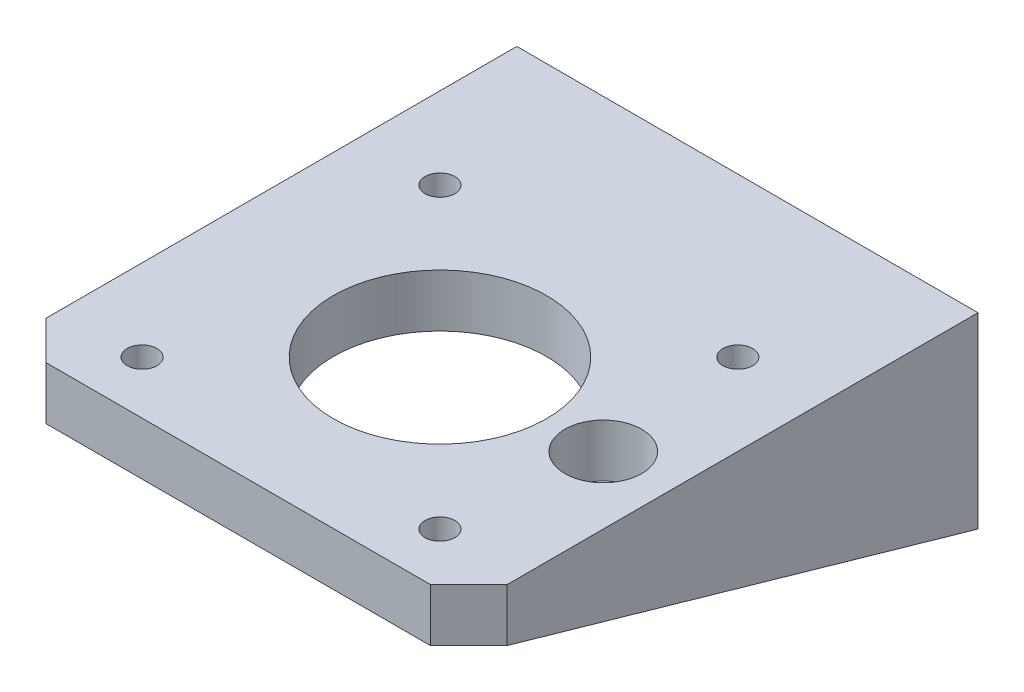
ISO-10303-21;
HEADER;
FILE_DESCRIPTION(('STEP AP214'),'2;1');
FILE_NAME('part.step','',(''),(''),'','','');
FILE_SCHEMA(('AUTOMOTIVE_DESIGN { 1 0 10303 214 1 1 1 1 }'));
ENDSEC;
DATA;
#1=APPLICATION_CONTEXT('core data for automotive mechanical design processes');
#2=APPLICATION_PROTOCOL_DEFINITION('international standard','automotive_design',2000,#1);
#3=PRODUCT_CONTEXT('',#1,'mechanical');
#4=PRODUCT('Part','Part','',(#3));
#5=PRODUCT_RELATED_PRODUCT_CATEGORY('part','',(#4));
#6=PRODUCT_DEFINITION_FORMATION('','',#4);
#7=PRODUCT_DEFINITION_CONTEXT('part definition',#1,'design');
#8=PRODUCT_DEFINITION('design','',#6,#7);
#9=PRODUCT_DEFINITION_SHAPE('','',#8);
#10=(LENGTH_UNIT() NAMED_UNIT(*) SI_UNIT(.MILLI.,.METRE.));
#11=(NAMED_UNIT(*) PLANE_ANGLE_UNIT() SI_UNIT($,.RADIAN.));
#12=(NAMED_UNIT(*) SI_UNIT($,.STERADIAN.) SOLID_ANGLE_UNIT());
#13=UNCERTAINTY_MEASURE_WITH_UNIT(LENGTH_MEASURE(1.E-05),#10,'distance_accuracy_value','');
#14=(GEOMETRIC_REPRESENTATION_CONTEXT(3) GLOBAL_UNCERTAINTY_ASSIGNED_CONTEXT((#13)) GLOBAL_UNIT_ASSIGNED_CONTEXT((#10,
#11,#12)) REPRESENTATION_CONTEXT('',''));
#15=CARTESIAN_POINT('',(0.,0.,0.));
#16=DIRECTION('',(0.,0.,1.));
#17=DIRECTION('',(1.,0.,0.));
#18=AXIS2_PLACEMENT_3D('',#15,#16,#17);
#19=CARTESIAN_POINT('',(39.,-5.71428571428571,-57.3840620433566));
#20=DIRECTION('',(0.,0.,1.));
#21=DIRECTION('',(1.,0.,0.));
#22=AXIS2_PLACEMENT_3D('',#19,#20,#21);
#23=CYLINDRICAL_SURFACE('',#22,1.55);
#24=CARTESIAN_POINT('',(39.,-5.71428571428571,-53.));
#25=DIRECTION('',(0.,0.,1.));
#26=DIRECTION('',(1.,0.,0.));
#27=AXIS2_PLACEMENT_3D('',#24,#25,#26);
#28=CIRCLE('',#27,1.55);
#29=CARTESIAN_POINT('',(40.55,-5.71428571428571,-53.));
#30=VERTEX_POINT('',#29);
#31=EDGE_CURVE('E248',#30,#30,#28,.F.);
#32=ORIENTED_EDGE('',*,*,#31,.T.);
#33=EDGE_LOOP('',(#32));
#34=FACE_BOUND('',#33,.T.);
#35=CARTESIAN_POINT('',(39.,-5.71428571428571,-47.));
#36=DIRECTION('',(0.,0.,1.));
#37=DIRECTION('',(1.,0.,0.));
#38=AXIS2_PLACEMENT_3D('',#35,#36,#37);
#39=CIRCLE('',#38,1.55);
#40=CARTESIAN_POINT('',(40.55,-5.71428571428571,-47.));
#41=VERTEX_POINT('',#40);
#42=EDGE_CURVE('E265',#41,#41,#39,.F.);
#43=ORIENTED_EDGE('',*,*,#42,.F.);
#44=EDGE_LOOP('',(#43));
#45=FACE_BOUND('',#44,.T.);
#46=ADVANCED_FACE('F33',(#34,#45),#23,.F.);
#47=CARTESIAN_POINT('',(9.,-5.71428571428571,-57.3840620433566));
#48=DIRECTION('',(0.,0.,1.));
#49=DIRECTION('',(1.,0.,0.));
#50=AXIS2_PLACEMENT_3D('',#47,#48,#49);
#51=CYLINDRICAL_SURFACE('',#50,1.55);
#52=CARTESIAN_POINT('',(9.,-5.71428571428571,-53.));
#53=DIRECTION('',(0.,0.,1.));
#54=DIRECTION('',(1.,0.,0.));
#55=AXIS2_PLACEMENT_3D('',#52,#53,#54);
#56=CIRCLE('',#55,1.55);
#57=CARTESIAN_POINT('',(10.55,-5.71428571428571,-53.));
#58=VERTEX_POINT('',#57);
#59=EDGE_CURVE('E246',#58,#58,#56,.F.);
#60=ORIENTED_EDGE('',*,*,#59,.T.);
#61=EDGE_LOOP('',(#60));
#62=FACE_BOUND('',#61,.T.);
#63=CARTESIAN_POINT('',(9.,-5.71428571428571,-47.));
#64=DIRECTION('',(0.,0.,1.));
#65=DIRECTION('',(1.,0.,0.));
#66=AXIS2_PLACEMENT_3D('',#63,#64,#65);
#67=CIRCLE('',#66,1.55);
#68=CARTESIAN_POINT('',(10.55,-5.71428571428571,-47.));
#69=VERTEX_POINT('',#68);
#70=EDGE_CURVE('E257',#69,#69,#67,.F.);
#71=ORIENTED_EDGE('',*,*,#70,.F.);
#72=EDGE_LOOP('',(#71));
#73=FACE_BOUND('',#72,.T.);
#74=ADVANCED_FACE('F275',(#62,#73),#51,.F.);
#75=CARTESIAN_POINT('',(0.,0.,0.));
#76=DIRECTION('',(0.,-1.,0.));
#77=DIRECTION('',(0.,0.,-1.));
#78=AXIS2_PLACEMENT_3D('',#75,#76,#77);
#79=PLANE('',#78);
#80=CARTESIAN_POINT('',(24.,0.,-21.));
#81=DIRECTION('',(0.,1.,0.));
#82=DIRECTION('',(0.,0.,1.));
#83=AXIS2_PLACEMENT_3D('',#80,#81,#82);
#84=CIRCLE('',#83,11.1);
#85=CARTESIAN_POINT('',(24.,0.,-9.89999999999999));
#86=VERTEX_POINT('',#85);
#87=EDGE_CURVE('E170',#86,#86,#84,.T.);
#88=ORIENTED_EDGE('',*,*,#87,.T.);
#89=EDGE_LOOP('',(#88));
#90=FACE_BOUND('',#89,.T.);
#91=CARTESIAN_POINT('',(8.5,0.,-5.5));
#92=DIRECTION('',(0.,1.,0.));
#93=DIRECTION('',(0.,0.,1.));
#94=AXIS2_PLACEMENT_3D('',#91,#92,#93);
#95=CIRCLE('',#94,1.55);
#96=CARTESIAN_POINT('',(8.5,0.,-3.95));
#97=VERTEX_POINT('',#96);
#98=EDGE_CURVE('E182',#97,#97,#95,.T.);
#99=ORIENTED_EDGE('',*,*,#98,.T.);
#100=EDGE_LOOP('',(#99));
#101=FACE_BOUND('',#100,.T.);
#102=CARTESIAN_POINT('',(8.5,0.,-36.5));
#103=DIRECTION('',(0.,1.,0.));
#104=DIRECTION('',(0.,0.,1.));
#105=AXIS2_PLACEMENT_3D('',#102,#103,#104);
#106=CIRCLE('',#105,1.55);
#107=CARTESIAN_POINT('',(8.5,0.,-34.95));
#108=VERTEX_POINT('',#107);
#109=EDGE_CURVE('E194',#108,#108,#106,.T.);
#110=ORIENTED_EDGE('',*,*,#109,.T.);
#111=EDGE_LOOP('',(#110));
#112=FACE_BOUND('',#111,.T.);
#113=CARTESIAN_POINT('',(39.5,0.,-36.5));
#114=DIRECTION('',(0.,1.,0.));
#115=DIRECTION('',(0.,0.,1.));
#116=AXIS2_PLACEMENT_3D('',#113,#114,#115);
#117=CIRCLE('',#116,1.55);
#118=CARTESIAN_POINT('',(39.5,0.,-34.95));
#119=VERTEX_POINT('',#118);
#120=EDGE_CURVE('E188',#119,#119,#117,.T.);
#121=ORIENTED_EDGE('',*,*,#120,.T.);
#122=EDGE_LOOP('',(#121));
#123=FACE_BOUND('',#122,.T.);
#124=CARTESIAN_POINT('',(39.5,0.,-5.5));
#125=DIRECTION('',(0.,1.,0.));
#126=DIRECTION('',(0.,0.,1.));
#127=AXIS2_PLACEMENT_3D('',#124,#125,#126);
#128=CIRCLE('',#127,1.55);
#129=CARTESIAN_POINT('',(39.5,0.,-3.95));
#130=VERTEX_POINT('',#129);
#131=EDGE_CURVE('E176',#130,#130,#128,.T.);
#132=ORIENTED_EDGE('',*,*,#131,.T.);
#133=EDGE_LOOP('',(#132));
#134=FACE_BOUND('',#133,.T.);
#135=DIRECTION('',(0.,0.,-1.));
#136=VECTOR('',#135,1.);
#137=CARTESIAN_POINT('',(3.,0.,0.));
#138=LINE('',#137,#136);
#139=CARTESIAN_POINT('',(3.,0.,-4.));
#140=VERTEX_POINT('',#139);
#141=CARTESIAN_POINT('',(3.,0.,-44.));
#142=VERTEX_POINT('',#141);
#143=EDGE_CURVE('E158',#140,#142,#138,.T.);
#144=ORIENTED_EDGE('',*,*,#143,.T.);
#145=DIRECTION('',(-1.,0.,0.));
#146=VECTOR('',#145,1.);
#147=CARTESIAN_POINT('',(3.,0.,-44.));
#148=LINE('',#147,#146);
#149=CARTESIAN_POINT('',(45.,0.,-44.));
#150=VERTEX_POINT('',#149);
#151=EDGE_CURVE('E245',#150,#142,#148,.T.);
#152=ORIENTED_EDGE('',*,*,#151,.F.);
#153=DIRECTION('',(0.,0.,1.));
#154=VECTOR('',#153,1.);
#155=CARTESIAN_POINT('',(45.,0.,0.));
#156=LINE('',#155,#154);
#157=CARTESIAN_POINT('',(45.,0.,-21.));
#158=VERTEX_POINT('',#157);
#159=EDGE_CURVE('E134',#150,#158,#156,.T.);
#160=ORIENTED_EDGE('',*,*,#159,.T.);
#161=CARTESIAN_POINT('',(41.,0.,-21.));
#162=DIRECTION('',(0.,1.,0.));
#163=DIRECTION('',(0.,0.,1.));
#164=AXIS2_PLACEMENT_3D('',#161,#162,#163);
#165=CIRCLE('',#164,4.00000000000001);
#166=EDGE_CURVE('E166',#158,#158,#165,.T.);
#167=ORIENTED_EDGE('',*,*,#166,.T.);
#168=CARTESIAN_POINT('',(45.,0.,-4.00000000000001));
#169=VERTEX_POINT('',#168);
#170=EDGE_CURVE('E141',#158,#169,#156,.T.);
#171=ORIENTED_EDGE('',*,*,#170,.T.);
#172=DIRECTION('',(1.,0.,0.));
#173=VECTOR('',#172,1.);
#174=CARTESIAN_POINT('',(45.,0.,-4.00000000000001));
#175=LINE('',#174,#173);
#176=CARTESIAN_POINT('',(48.,0.,-4.00000000000001));
#177=VERTEX_POINT('',#176);
#178=EDGE_CURVE('E138',#169,#177,#175,.T.);
#179=ORIENTED_EDGE('',*,*,#178,.T.);
#180=DIRECTION('',(0.707106781186547,0.,-0.707106781186548));
#181=VECTOR('',#180,1.);
#182=CARTESIAN_POINT('',(48.,0.,-4.));
#183=LINE('',#182,#181);
#184=CARTESIAN_POINT('',(44.,0.,0.));
#185=VERTEX_POINT('',#184);
#186=EDGE_CURVE('E204',#185,#177,#183,.T.);
#187=ORIENTED_EDGE('',*,*,#186,.F.);
#188=DIRECTION('',(1.,0.,0.));
#189=VECTOR('',#188,1.);
#190=CARTESIAN_POINT('',(44.,0.,0.));
#191=LINE('',#190,#189);
#192=CARTESIAN_POINT('',(4.,0.,0.));
#193=VERTEX_POINT('',#192);
#194=EDGE_CURVE('E72',#193,#185,#191,.T.);
#195=ORIENTED_EDGE('',*,*,#194,.F.);
#196=DIRECTION('',(0.707106781186547,0.,0.707106781186548));
#197=VECTOR('',#196,1.);
#198=CARTESIAN_POINT('',(4.,0.,0.));
#199=LINE('',#198,#197);
#200=CARTESIAN_POINT('',(0.,0.,-4.));
#201=VERTEX_POINT('',#200);
#202=EDGE_CURVE('E65',#201,#193,#199,.T.);
#203=ORIENTED_EDGE('',*,*,#202,.F.);
#204=DIRECTION('',(-1.,0.,0.));
#205=VECTOR('',#204,1.);
#206=CARTESIAN_POINT('',(3.,0.,-4.));
#207=LINE('',#206,#205);
#208=EDGE_CURVE('E156',#140,#201,#207,.T.);
#209=ORIENTED_EDGE('',*,*,#208,.F.);
#210=EDGE_LOOP('',(#144,#152,#160,#167,#171,#179,#187,#195,#203,#209));
#211=FACE_BOUND('',#210,.T.);
#212=ADVANCED_FACE('F228',(#90,#101,#112,#123,#134,#211),#79,.T.);
#213=CARTESIAN_POINT('',(3.,0.,0.));
#214=DIRECTION('',(-1.,0.,0.));
#215=DIRECTION('',(0.,0.,1.));
#216=AXIS2_PLACEMENT_3D('',#213,#214,#215);
#217=PLANE('',#216);
#218=DIRECTION('',(0.,1.,0.));
#219=VECTOR('',#218,1.);
#220=CARTESIAN_POINT('',(3.,-14.,-44.));
#221=LINE('',#220,#219);
#222=CARTESIAN_POINT('',(3.,-11.4285714285714,-44.));
#223=VERTEX_POINT('',#222);
#224=EDGE_CURVE('E121',#223,#142,#221,.T.);
#225=ORIENTED_EDGE('',*,*,#224,.T.);
#226=ORIENTED_EDGE('',*,*,#143,.F.);
#227=DIRECTION('',(0.,0.274721127897378,0.961523947640823));
#228=VECTOR('',#227,1.);
#229=CARTESIAN_POINT('',(3.,-14.,-53.));
#230=LINE('',#229,#228);
#231=EDGE_CURVE('E152',#223,#140,#230,.T.);
#232=ORIENTED_EDGE('',*,*,#231,.F.);
#233=EDGE_LOOP('',(#225,#226,#232));
#234=FACE_BOUND('',#233,.T.);
#235=ADVANCED_FACE('F244',(#234),#217,.F.);
#236=CARTESIAN_POINT('',(45.,0.,0.));
#237=DIRECTION('',(1.,0.,0.));
#238=DIRECTION('',(0.,0.,-1.));
#239=AXIS2_PLACEMENT_3D('',#236,#237,#238);
#240=PLANE('',#239);
#241=DIRECTION('',(0.,1.,0.));
#242=VECTOR('',#241,1.);
#243=CARTESIAN_POINT('',(45.,0.,-44.));
#244=LINE('',#243,#242);
#245=CARTESIAN_POINT('',(45.,-11.4285714285714,-44.));
#246=VERTEX_POINT('',#245);
#247=EDGE_CURVE('E11',#246,#150,#244,.T.);
#248=ORIENTED_EDGE('',*,*,#247,.F.);
#249=DIRECTION('',(0.,-0.274721127897378,-0.961523947640823));
#250=VECTOR('',#249,1.);
#251=CARTESIAN_POINT('',(45.,-14.,-53.));
#252=LINE('',#251,#250);
#253=EDGE_CURVE('E132',#169,#246,#252,.T.);
#254=ORIENTED_EDGE('',*,*,#253,.F.);
#255=ORIENTED_EDGE('',*,*,#170,.F.);
#256=ORIENTED_EDGE('',*,*,#159,.F.);
#257=EDGE_LOOP('',(#248,#254,#255,#256));
#258=FACE_BOUND('',#257,.T.);
#259=ADVANCED_FACE('F130',(#258),#240,.F.);
#260=CARTESIAN_POINT('',(0.,5.5,0.));
#261=DIRECTION('',(0.,-1.,0.));
#262=DIRECTION('',(0.,0.,-1.));
#263=AXIS2_PLACEMENT_3D('',#260,#261,#262);
#264=PLANE('',#263);
#265=CARTESIAN_POINT('',(41.,5.5,-21.));
#266=DIRECTION('',(0.,1.,0.));
#267=DIRECTION('',(0.,0.,1.));
#268=AXIS2_PLACEMENT_3D('',#265,#266,#267);
#269=CIRCLE('',#268,4.00000000000001);
#270=CARTESIAN_POINT('',(41.,5.5,-17.));
#271=VERTEX_POINT('',#270);
#272=EDGE_CURVE('E167',#271,#271,#269,.T.);
#273=ORIENTED_EDGE('',*,*,#272,.F.);
#274=EDGE_LOOP('',(#273));
#275=FACE_BOUND('',#274,.T.);
#276=DIRECTION('',(0.707106781186547,0.,-0.707106781186548));
#277=VECTOR('',#276,1.);
#278=CARTESIAN_POINT('',(48.,5.5,-4.));
#279=LINE('',#278,#277);
#280=CARTESIAN_POINT('',(44.,5.5,0.));
#281=VERTEX_POINT('',#280);
#282=CARTESIAN_POINT('',(48.,5.5,-4.));
#283=VERTEX_POINT('',#282);
#284=EDGE_CURVE('E50',#281,#283,#279,.T.);
#285=ORIENTED_EDGE('',*,*,#284,.T.);
#286=DIRECTION('',(0.,0.,-1.));
#287=VECTOR('',#286,1.);
#288=CARTESIAN_POINT('',(48.,5.5,-49.));
#289=LINE('',#288,#287);
#290=CARTESIAN_POINT('',(48.,5.5,-53.));
#291=VERTEX_POINT('',#290);
#292=EDGE_CURVE('E209',#283,#291,#289,.T.);
#293=ORIENTED_EDGE('',*,*,#292,.T.);
#294=DIRECTION('',(-1.,0.,0.));
#295=VECTOR('',#294,1.);
#296=CARTESIAN_POINT('',(4.,5.5,-53.));
#297=LINE('',#296,#295);
#298=CARTESIAN_POINT('',(0.,5.5,-53.));
#299=VERTEX_POINT('',#298);
#300=EDGE_CURVE('E211',#291,#299,#297,.T.);
#301=ORIENTED_EDGE('',*,*,#300,.T.);
#302=DIRECTION('',(0.,0.,1.));
#303=VECTOR('',#302,1.);
#304=CARTESIAN_POINT('',(0.,5.5,-4.));
#305=LINE('',#304,#303);
#306=CARTESIAN_POINT('',(0.,5.5,-4.));
#307=VERTEX_POINT('',#306);
#308=EDGE_CURVE('E79',#299,#307,#305,.T.);
#309=ORIENTED_EDGE('',*,*,#308,.T.);
#310=DIRECTION('',(0.707106781186547,0.,0.707106781186548));
#311=VECTOR('',#310,1.);
#312=CARTESIAN_POINT('',(4.,5.5,0.));
#313=LINE('',#312,#311);
#314=CARTESIAN_POINT('',(4.,5.5,0.));
#315=VERTEX_POINT('',#314);
#316=EDGE_CURVE('E203',#307,#315,#313,.T.);
#317=ORIENTED_EDGE('',*,*,#316,.T.);
#318=DIRECTION('',(1.,0.,0.));
#319=VECTOR('',#318,1.);
#320=CARTESIAN_POINT('',(44.,5.5,0.));
#321=LINE('',#320,#319);
#322=EDGE_CURVE('E206',#315,#281,#321,.T.);
#323=ORIENTED_EDGE('',*,*,#322,.T.);
#324=EDGE_LOOP('',(#285,#293,#301,#309,#317,#323));
#325=FACE_BOUND('',#324,.T.);
#326=CARTESIAN_POINT('',(8.5,5.5,-36.5));
#327=DIRECTION('',(0.,1.,0.));
#328=DIRECTION('',(0.,0.,1.));
#329=AXIS2_PLACEMENT_3D('',#326,#327,#328);
#330=CIRCLE('',#329,1.55);
#331=CARTESIAN_POINT('',(8.5,5.5,-34.95));
#332=VERTEX_POINT('',#331);
#333=EDGE_CURVE('E197',#332,#332,#330,.T.);
#334=ORIENTED_EDGE('',*,*,#333,.F.);
#335=EDGE_LOOP('',(#334));
#336=FACE_BOUND('',#335,.T.);
#337=CARTESIAN_POINT('',(39.5,5.5,-36.5));
#338=DIRECTION('',(0.,1.,0.));
#339=DIRECTION('',(0.,0.,1.));
#340=AXIS2_PLACEMENT_3D('',#337,#338,#339);
#341=CIRCLE('',#340,1.55);
#342=CARTESIAN_POINT('',(39.5,5.5,-34.95));
#343=VERTEX_POINT('',#342);
#344=EDGE_CURVE('E191',#343,#343,#341,.T.);
#345=ORIENTED_EDGE('',*,*,#344,.F.);
#346=EDGE_LOOP('',(#345));
#347=FACE_BOUND('',#346,.T.);
#348=CARTESIAN_POINT('',(8.5,5.5,-5.5));
#349=DIRECTION('',(0.,1.,0.));
#350=DIRECTION('',(0.,0.,1.));
#351=AXIS2_PLACEMENT_3D('',#348,#349,#350);
#352=CIRCLE('',#351,1.55);
#353=CARTESIAN_POINT('',(8.5,5.5,-3.95));
#354=VERTEX_POINT('',#353);
#355=EDGE_CURVE('E185',#354,#354,#352,.T.);
#356=ORIENTED_EDGE('',*,*,#355,.F.);
#357=EDGE_LOOP('',(#356));
#358=FACE_BOUND('',#357,.T.);
#359=CARTESIAN_POINT('',(39.5,5.5,-5.5));
#360=DIRECTION('',(0.,1.,0.));
#361=DIRECTION('',(0.,0.,1.));
#362=AXIS2_PLACEMENT_3D('',#359,#360,#361);
#363=CIRCLE('',#362,1.55);
#364=CARTESIAN_POINT('',(39.5,5.5,-3.95));
#365=VERTEX_POINT('',#364);
#366=EDGE_CURVE('E179',#365,#365,#363,.T.);
#367=ORIENTED_EDGE('',*,*,#366,.F.);
#368=EDGE_LOOP('',(#367));
#369=FACE_BOUND('',#368,.T.);
#370=CARTESIAN_POINT('',(24.,5.5,-21.));
#371=DIRECTION('',(0.,1.,0.));
#372=DIRECTION('',(0.,0.,1.));
#373=AXIS2_PLACEMENT_3D('',#370,#371,#372);
#374=CIRCLE('',#373,11.1);
#375=CARTESIAN_POINT('',(24.,5.5,-9.89999999999999));
#376=VERTEX_POINT('',#375);
#377=EDGE_CURVE('E173',#376,#376,#374,.T.);
#378=ORIENTED_EDGE('',*,*,#377,.F.);
#379=EDGE_LOOP('',(#378));
#380=FACE_BOUND('',#379,.T.);
#381=ADVANCED_FACE('F237',(#275,#325,#336,#347,#358,#369,#380),#264,.F.);
#382=CARTESIAN_POINT('',(0.,5.5,-4.));
#383=DIRECTION('',(1.,0.,0.));
#384=DIRECTION('',(0.,0.,-1.));
#385=AXIS2_PLACEMENT_3D('',#382,#383,#384);
#386=PLANE('',#385);
#387=DIRECTION('',(0.,1.,0.));
#388=VECTOR('',#387,1.);
#389=CARTESIAN_POINT('',(0.,0.,-53.));
#390=LINE('',#389,#388);
#391=CARTESIAN_POINT('',(0.,-14.,-53.));
#392=VERTEX_POINT('',#391);
#393=EDGE_CURVE('E163',#392,#299,#390,.T.);
#394=ORIENTED_EDGE('',*,*,#393,.F.);
#395=DIRECTION('',(0.,0.274721127897378,0.961523947640823));
#396=VECTOR('',#395,1.);
#397=CARTESIAN_POINT('',(0.,-14.,-53.));
#398=LINE('',#397,#396);
#399=EDGE_CURVE('E151',#392,#201,#398,.T.);
#400=ORIENTED_EDGE('',*,*,#399,.T.);
#401=DIRECTION('',(0.,-1.,0.));
#402=VECTOR('',#401,1.);
#403=CARTESIAN_POINT('',(0.,5.5,-4.));
#404=LINE('',#403,#402);
#405=EDGE_CURVE('E42',#307,#201,#404,.T.);
#406=ORIENTED_EDGE('',*,*,#405,.F.);
#407=ORIENTED_EDGE('',*,*,#308,.F.);
#408=EDGE_LOOP('',(#394,#400,#406,#407));
#409=FACE_BOUND('',#408,.T.);
#410=ADVANCED_FACE('F35',(#409),#386,.F.);
#411=CARTESIAN_POINT('',(4.,5.5,0.));
#412=DIRECTION('',(0.707106781186548,0.,-0.707106781186547));
#413=DIRECTION('',(-0.707106781186547,0.,-0.707106781186548));
#414=AXIS2_PLACEMENT_3D('',#411,#412,#413);
#415=PLANE('',#414);
#416=ORIENTED_EDGE('',*,*,#202,.T.);
#417=DIRECTION('',(0.,-1.,0.));
#418=VECTOR('',#417,1.);
#419=CARTESIAN_POINT('',(4.,5.5,0.));
#420=LINE('',#419,#418);
#421=EDGE_CURVE('E222',#315,#193,#420,.T.);
#422=ORIENTED_EDGE('',*,*,#421,.F.);
#423=ORIENTED_EDGE('',*,*,#316,.F.);
#424=ORIENTED_EDGE('',*,*,#405,.T.);
#425=EDGE_LOOP('',(#416,#422,#423,#424));
#426=FACE_BOUND('',#425,.T.);
#427=ADVANCED_FACE('F224',(#426),#415,.F.);
#428=CARTESIAN_POINT('',(44.,5.5,0.));
#429=DIRECTION('',(0.,0.,-1.));
#430=DIRECTION('',(-1.,0.,0.));
#431=AXIS2_PLACEMENT_3D('',#428,#429,#430);
#432=PLANE('',#431);
#433=ORIENTED_EDGE('',*,*,#194,.T.);
#434=DIRECTION('',(0.,-1.,0.));
#435=VECTOR('',#434,1.);
#436=CARTESIAN_POINT('',(44.,5.5,0.));
#437=LINE('',#436,#435);
#438=EDGE_CURVE('E220',#281,#185,#437,.T.);
#439=ORIENTED_EDGE('',*,*,#438,.F.);
#440=ORIENTED_EDGE('',*,*,#322,.F.);
#441=ORIENTED_EDGE('',*,*,#421,.T.);
#442=EDGE_LOOP('',(#433,#439,#440,#441));
#443=FACE_BOUND('',#442,.T.);
#444=ADVANCED_FACE('F333',(#443),#432,.F.);
#445=CARTESIAN_POINT('',(48.,5.5,-4.));
#446=DIRECTION('',(-0.707106781186548,0.,-0.707106781186547));
#447=DIRECTION('',(-0.707106781186547,0.,0.707106781186548));
#448=AXIS2_PLACEMENT_3D('',#445,#446,#447);
#449=PLANE('',#448);
#450=ORIENTED_EDGE('',*,*,#186,.T.);
#451=DIRECTION('',(0.,-1.,0.));
#452=VECTOR('',#451,1.);
#453=CARTESIAN_POINT('',(48.,5.5,-4.));
#454=LINE('',#453,#452);
#455=EDGE_CURVE('E213',#283,#177,#454,.T.);
#456=ORIENTED_EDGE('',*,*,#455,.F.);
#457=ORIENTED_EDGE('',*,*,#284,.F.);
#458=ORIENTED_EDGE('',*,*,#438,.T.);
#459=EDGE_LOOP('',(#450,#456,#457,#458));
#460=FACE_BOUND('',#459,.T.);
#461=ADVANCED_FACE('F231',(#460),#449,.F.);
#462=CARTESIAN_POINT('',(48.,5.5,-49.));
#463=DIRECTION('',(-1.,0.,0.));
#464=DIRECTION('',(0.,0.,1.));
#465=AXIS2_PLACEMENT_3D('',#462,#463,#464);
#466=PLANE('',#465);
#467=ORIENTED_EDGE('',*,*,#455,.T.);
#468=DIRECTION('',(0.,-0.274721127897378,-0.961523947640823));
#469=VECTOR('',#468,1.);
#470=CARTESIAN_POINT('',(48.,-14.,-53.));
#471=LINE('',#470,#469);
#472=CARTESIAN_POINT('',(48.,-14.,-53.));
#473=VERTEX_POINT('',#472);
#474=EDGE_CURVE('E139',#177,#473,#471,.T.);
#475=ORIENTED_EDGE('',*,*,#474,.T.);
#476=DIRECTION('',(0.,1.,0.));
#477=VECTOR('',#476,1.);
#478=CARTESIAN_POINT('',(48.,0.,-53.));
#479=LINE('',#478,#477);
#480=EDGE_CURVE('E148',#473,#291,#479,.T.);
#481=ORIENTED_EDGE('',*,*,#480,.T.);
#482=ORIENTED_EDGE('',*,*,#292,.F.);
#483=EDGE_LOOP('',(#467,#475,#481,#482));
#484=FACE_BOUND('',#483,.T.);
#485=ADVANCED_FACE('F234',(#484),#466,.F.);
#486=CARTESIAN_POINT('',(4.,5.5,-53.));
#487=DIRECTION('',(0.,0.,1.));
#488=DIRECTION('',(1.,0.,0.));
#489=AXIS2_PLACEMENT_3D('',#486,#487,#488);
#490=PLANE('',#489);
#491=ORIENTED_EDGE('',*,*,#31,.F.);
#492=EDGE_LOOP('',(#491));
#493=FACE_BOUND('',#492,.T.);
#494=ORIENTED_EDGE('',*,*,#59,.F.);
#495=EDGE_LOOP('',(#494));
#496=FACE_BOUND('',#495,.T.);
#497=ORIENTED_EDGE('',*,*,#480,.F.);
#498=DIRECTION('',(-1.,0.,0.));
#499=VECTOR('',#498,1.);
#500=CARTESIAN_POINT('',(3.,-14.,-53.));
#501=LINE('',#500,#499);
#502=EDGE_CURVE('E154',#473,#392,#501,.T.);
#503=ORIENTED_EDGE('',*,*,#502,.T.);
#504=ORIENTED_EDGE('',*,*,#393,.T.);
#505=ORIENTED_EDGE('',*,*,#300,.F.);
#506=EDGE_LOOP('',(#497,#503,#504,#505));
#507=FACE_BOUND('',#506,.T.);
#508=ADVANCED_FACE('F240',(#493,#496,#507),#490,.F.);
#509=CARTESIAN_POINT('',(8.5,5.5,-36.5));
#510=DIRECTION('',(0.,-1.,0.));
#511=DIRECTION('',(0.,0.,-1.));
#512=AXIS2_PLACEMENT_3D('',#509,#510,#511);
#513=CYLINDRICAL_SURFACE('',#512,1.55);
#514=ORIENTED_EDGE('',*,*,#333,.T.);
#515=EDGE_LOOP('',(#514));
#516=FACE_BOUND('',#515,.T.);
#517=ORIENTED_EDGE('',*,*,#109,.F.);
#518=EDGE_LOOP('',(#517));
#519=FACE_BOUND('',#518,.T.);
#520=ADVANCED_FACE('F315',(#516,#519),#513,.F.);
#521=CARTESIAN_POINT('',(39.5,5.5,-36.5));
#522=DIRECTION('',(0.,-1.,0.));
#523=DIRECTION('',(0.,0.,-1.));
#524=AXIS2_PLACEMENT_3D('',#521,#522,#523);
#525=CYLINDRICAL_SURFACE('',#524,1.55);
#526=ORIENTED_EDGE('',*,*,#344,.T.);
#527=EDGE_LOOP('',(#526));
#528=FACE_BOUND('',#527,.T.);
#529=ORIENTED_EDGE('',*,*,#120,.F.);
#530=EDGE_LOOP('',(#529));
#531=FACE_BOUND('',#530,.T.);
#532=ADVANCED_FACE('F311',(#528,#531),#525,.F.);
#533=CARTESIAN_POINT('',(8.5,5.5,-5.5));
#534=DIRECTION('',(0.,-1.,0.));
#535=DIRECTION('',(0.,0.,-1.));
#536=AXIS2_PLACEMENT_3D('',#533,#534,#535);
#537=CYLINDRICAL_SURFACE('',#536,1.55);
#538=ORIENTED_EDGE('',*,*,#355,.T.);
#539=EDGE_LOOP('',(#538));
#540=FACE_BOUND('',#539,.T.);
#541=ORIENTED_EDGE('',*,*,#98,.F.);
#542=EDGE_LOOP('',(#541));
#543=FACE_BOUND('',#542,.T.);
#544=ADVANCED_FACE('F307',(#540,#543),#537,.F.);
#545=CARTESIAN_POINT('',(39.5,5.5,-5.5));
#546=DIRECTION('',(0.,-1.,0.));
#547=DIRECTION('',(0.,0.,-1.));
#548=AXIS2_PLACEMENT_3D('',#545,#546,#547);
#549=CYLINDRICAL_SURFACE('',#548,1.55);
#550=ORIENTED_EDGE('',*,*,#366,.T.);
#551=EDGE_LOOP('',(#550));
#552=FACE_BOUND('',#551,.T.);
#553=ORIENTED_EDGE('',*,*,#131,.F.);
#554=EDGE_LOOP('',(#553));
#555=FACE_BOUND('',#554,.T.);
#556=ADVANCED_FACE('F303',(#552,#555),#549,.F.);
#557=CARTESIAN_POINT('',(24.,5.5,-21.));
#558=DIRECTION('',(0.,-1.,0.));
#559=DIRECTION('',(0.,0.,-1.));
#560=AXIS2_PLACEMENT_3D('',#557,#558,#559);
#561=CYLINDRICAL_SURFACE('',#560,11.1);
#562=ORIENTED_EDGE('',*,*,#377,.T.);
#563=EDGE_LOOP('',(#562));
#564=FACE_BOUND('',#563,.T.);
#565=ORIENTED_EDGE('',*,*,#87,.F.);
#566=EDGE_LOOP('',(#565));
#567=FACE_BOUND('',#566,.T.);
#568=ADVANCED_FACE('F299',(#564,#567),#561,.F.);
#569=CARTESIAN_POINT('',(41.,5.5,-21.));
#570=DIRECTION('',(0.,-1.,0.));
#571=DIRECTION('',(0.,0.,-1.));
#572=AXIS2_PLACEMENT_3D('',#569,#570,#571);
#573=CYLINDRICAL_SURFACE('',#572,4.00000000000001);
#574=ORIENTED_EDGE('',*,*,#166,.F.);
#575=EDGE_LOOP('',(#574));
#576=FACE_BOUND('',#575,.T.);
#577=ORIENTED_EDGE('',*,*,#272,.T.);
#578=EDGE_LOOP('',(#577));
#579=FACE_BOUND('',#578,.T.);
#580=ADVANCED_FACE('F296',(#576,#579),#573,.F.);
#581=CARTESIAN_POINT('',(3.,-14.,-53.));
#582=DIRECTION('',(0.,-0.961523947640823,0.274721127897378));
#583=DIRECTION('',(0.,-0.274721127897378,-0.961523947640823));
#584=AXIS2_PLACEMENT_3D('',#581,#582,#583);
#585=PLANE('',#584);
#586=ORIENTED_EDGE('',*,*,#208,.T.);
#587=ORIENTED_EDGE('',*,*,#399,.F.);
#588=ORIENTED_EDGE('',*,*,#502,.F.);
#589=ORIENTED_EDGE('',*,*,#474,.F.);
#590=ORIENTED_EDGE('',*,*,#178,.F.);
#591=ORIENTED_EDGE('',*,*,#253,.T.);
#592=DIRECTION('',(-1.,0.,0.));
#593=VECTOR('',#592,1.);
#594=CARTESIAN_POINT('',(48.,-11.4285714285714,-44.));
#595=LINE('',#594,#593);
#596=EDGE_CURVE('E116',#246,#223,#595,.T.);
#597=ORIENTED_EDGE('',*,*,#596,.T.);
#598=ORIENTED_EDGE('',*,*,#231,.T.);
#599=EDGE_LOOP('',(#586,#587,#588,#589,#590,#591,#597,#598));
#600=FACE_BOUND('',#599,.T.);
#601=ADVANCED_FACE('F136',(#600),#585,.T.);
#602=CARTESIAN_POINT('',(3.,-14.,-44.));
#603=DIRECTION('',(0.,0.,-1.));
#604=DIRECTION('',(-1.,0.,0.));
#605=AXIS2_PLACEMENT_3D('',#602,#603,#604);
#606=PLANE('',#605);
#607=CARTESIAN_POINT('',(39.,-5.71428571428571,-44.));
#608=DIRECTION('',(0.,0.,1.));
#609=DIRECTION('',(1.,0.,0.));
#610=AXIS2_PLACEMENT_3D('',#607,#608,#609);
#611=CIRCLE('',#610,2.85);
#612=CARTESIAN_POINT('',(41.85,-5.71428571428571,-44.));
#613=VERTEX_POINT('',#612);
#614=EDGE_CURVE('E125',#613,#613,#611,.T.);
#615=ORIENTED_EDGE('',*,*,#614,.F.);
#616=EDGE_LOOP('',(#615));
#617=FACE_BOUND('',#616,.T.);
#618=CARTESIAN_POINT('',(9.,-5.71428571428571,-44.));
#619=DIRECTION('',(0.,0.,1.));
#620=DIRECTION('',(1.,0.,0.));
#621=AXIS2_PLACEMENT_3D('',#618,#619,#620);
#622=CIRCLE('',#621,2.85);
#623=CARTESIAN_POINT('',(11.85,-5.71428571428571,-44.));
#624=VERTEX_POINT('',#623);
#625=EDGE_CURVE('E254',#624,#624,#622,.T.);
#626=ORIENTED_EDGE('',*,*,#625,.F.);
#627=EDGE_LOOP('',(#626));
#628=FACE_BOUND('',#627,.T.);
#629=ORIENTED_EDGE('',*,*,#224,.F.);
#630=ORIENTED_EDGE('',*,*,#596,.F.);
#631=ORIENTED_EDGE('',*,*,#247,.T.);
#632=ORIENTED_EDGE('',*,*,#151,.T.);
#633=EDGE_LOOP('',(#629,#630,#631,#632));
#634=FACE_BOUND('',#633,.T.);
#635=ADVANCED_FACE('F118',(#617,#628,#634),#606,.F.);
#636=CARTESIAN_POINT('',(9.,-5.71428571428571,-47.));
#637=DIRECTION('',(0.,0.,1.));
#638=DIRECTION('',(1.,0.,0.));
#639=AXIS2_PLACEMENT_3D('',#636,#637,#638);
#640=CYLINDRICAL_SURFACE('',#639,2.85);
#641=CARTESIAN_POINT('',(9.,-5.71428571428571,-47.));
#642=DIRECTION('',(0.,0.,1.));
#643=DIRECTION('',(1.,0.,0.));
#644=AXIS2_PLACEMENT_3D('',#641,#642,#643);
#645=CIRCLE('',#644,2.85);
#646=CARTESIAN_POINT('',(11.85,-5.71428571428571,-47.));
#647=VERTEX_POINT('',#646);
#648=EDGE_CURVE('E253',#647,#647,#645,.T.);
#649=ORIENTED_EDGE('',*,*,#648,.F.);
#650=EDGE_LOOP('',(#649));
#651=FACE_BOUND('',#650,.T.);
#652=ORIENTED_EDGE('',*,*,#625,.T.);
#653=EDGE_LOOP('',(#652));
#654=FACE_BOUND('',#653,.T.);
#655=ADVANCED_FACE('F284',(#651,#654),#640,.F.);
#656=CARTESIAN_POINT('',(0.,0.,-47.));
#657=DIRECTION('',(0.,0.,1.));
#658=DIRECTION('',(1.,0.,0.));
#659=AXIS2_PLACEMENT_3D('',#656,#657,#658);
#660=PLANE('',#659);
#661=ORIENTED_EDGE('',*,*,#70,.T.);
#662=EDGE_LOOP('',(#661));
#663=FACE_BOUND('',#662,.T.);
#664=ORIENTED_EDGE('',*,*,#648,.T.);
#665=EDGE_LOOP('',(#664));
#666=FACE_BOUND('',#665,.T.);
#667=ADVANCED_FACE('F377',(#663,#666),#660,.T.);
#668=CARTESIAN_POINT('',(39.,-5.71428571428571,-47.));
#669=DIRECTION('',(0.,0.,1.));
#670=DIRECTION('',(1.,0.,0.));
#671=AXIS2_PLACEMENT_3D('',#668,#669,#670);
#672=CYLINDRICAL_SURFACE('',#671,2.85);
#673=CARTESIAN_POINT('',(39.,-5.71428571428571,-47.));
#674=DIRECTION('',(0.,0.,1.));
#675=DIRECTION('',(1.,0.,0.));
#676=AXIS2_PLACEMENT_3D('',#673,#674,#675);
#677=CIRCLE('',#676,2.85);
#678=CARTESIAN_POINT('',(41.85,-5.71428571428571,-47.));
#679=VERTEX_POINT('',#678);
#680=EDGE_CURVE('E258',#679,#679,#677,.T.);
#681=ORIENTED_EDGE('',*,*,#680,.F.);
#682=EDGE_LOOP('',(#681));
#683=FACE_BOUND('',#682,.T.);
#684=ORIENTED_EDGE('',*,*,#614,.T.);
#685=EDGE_LOOP('',(#684));
#686=FACE_BOUND('',#685,.T.);
#687=ADVANCED_FACE('F386',(#683,#686),#672,.F.);
#688=CARTESIAN_POINT('',(0.,0.,-47.));
#689=DIRECTION('',(0.,0.,1.));
#690=DIRECTION('',(1.,0.,0.));
#691=AXIS2_PLACEMENT_3D('',#688,#689,#690);
#692=PLANE('',#691);
#693=ORIENTED_EDGE('',*,*,#42,.T.);
#694=EDGE_LOOP('',(#693));
#695=FACE_BOUND('',#694,.T.);
#696=ORIENTED_EDGE('',*,*,#680,.T.);
#697=EDGE_LOOP('',(#696));
#698=FACE_BOUND('',#697,.T.);
#699=ADVANCED_FACE('F271',(#695,#698),#692,.T.);
#700=CLOSED_SHELL('',(#46,#74,#212,#235,#259,#381,#410,#427,#444,#461,#485,#508,#520,#532,#544,
#556,#568,#580,#601,#635,#655,#667,#687,#699));
#701=MANIFOLD_SOLID_BREP('B2',#700);
#702=ADVANCED_BREP_SHAPE_REPRESENTATION('',(#18,#701),#14);
#703=SHAPE_DEFINITION_REPRESENTATION(#9,#702);
ENDSEC;
END-ISO-10303-21;
